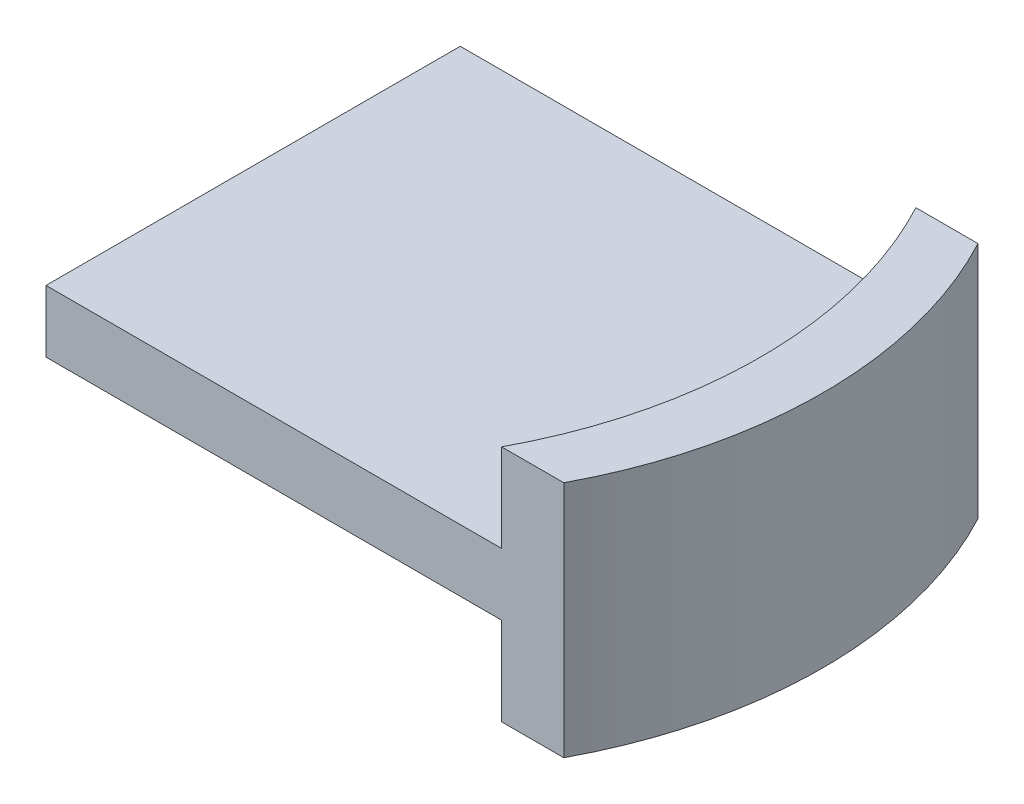
ISO-10303-21;
HEADER;
FILE_DESCRIPTION(('STEP AP214'),'2;1');
FILE_NAME('part.step','',(''),(''),'','','');
FILE_SCHEMA(('AUTOMOTIVE_DESIGN { 1 0 10303 214 1 1 1 1 }'));
ENDSEC;
DATA;
#1=APPLICATION_CONTEXT('core data for automotive mechanical design processes');
#2=APPLICATION_PROTOCOL_DEFINITION('international standard','automotive_design',2000,#1);
#3=PRODUCT_CONTEXT('',#1,'mechanical');
#4=PRODUCT('Part','Part','',(#3));
#5=PRODUCT_RELATED_PRODUCT_CATEGORY('part','',(#4));
#6=PRODUCT_DEFINITION_FORMATION('','',#4);
#7=PRODUCT_DEFINITION_CONTEXT('part definition',#1,'design');
#8=PRODUCT_DEFINITION('design','',#6,#7);
#9=PRODUCT_DEFINITION_SHAPE('','',#8);
#10=(LENGTH_UNIT() NAMED_UNIT(*) SI_UNIT(.MILLI.,.METRE.));
#11=(NAMED_UNIT(*) PLANE_ANGLE_UNIT() SI_UNIT($,.RADIAN.));
#12=(NAMED_UNIT(*) SI_UNIT($,.STERADIAN.) SOLID_ANGLE_UNIT());
#13=UNCERTAINTY_MEASURE_WITH_UNIT(LENGTH_MEASURE(1.E-05),#10,'distance_accuracy_value','');
#14=(GEOMETRIC_REPRESENTATION_CONTEXT(3) GLOBAL_UNCERTAINTY_ASSIGNED_CONTEXT((#13)) GLOBAL_UNIT_ASSIGNED_CONTEXT((#10,
#11,#12)) REPRESENTATION_CONTEXT('',''));
#15=CARTESIAN_POINT('',(0.,0.,0.));
#16=DIRECTION('',(0.,0.,1.));
#17=DIRECTION('',(1.,0.,0.));
#18=AXIS2_PLACEMENT_3D('',#15,#16,#17);
#19=CARTESIAN_POINT('',(-7.5,2.3,0.));
#20=DIRECTION('',(0.,-1.,0.));
#21=DIRECTION('',(0.,0.,-1.));
#22=AXIS2_PLACEMENT_3D('',#19,#20,#21);
#23=CYLINDRICAL_SURFACE('',#22,8.4999999999978);
#24=CARTESIAN_POINT('',(-7.5,0.6,0.));
#25=DIRECTION('',(0.,-1.,0.));
#26=DIRECTION('',(0.,0.,-1.));
#27=AXIS2_PLACEMENT_3D('',#24,#25,#26);
#28=CIRCLE('',#27,8.4999999999978);
#29=CARTESIAN_POINT('',(0.,0.6,4.));
#30=VERTEX_POINT('',#29);
#31=CARTESIAN_POINT('',(0.,0.6,-4.));
#32=VERTEX_POINT('',#31);
#33=EDGE_CURVE('E124',#30,#32,#28,.F.);
#34=ORIENTED_EDGE('',*,*,#33,.F.);
#35=DIRECTION('',(0.,-1.,0.));
#36=VECTOR('',#35,1.);
#37=CARTESIAN_POINT('',(0.,2.3,3.99999999999534));
#38=LINE('',#37,#36);
#39=CARTESIAN_POINT('',(0.,2.3,3.99999999999534));
#40=VERTEX_POINT('',#39);
#41=EDGE_CURVE('E11',#40,#30,#38,.T.);
#42=ORIENTED_EDGE('',*,*,#41,.F.);
#43=CARTESIAN_POINT('',(-7.5,2.3,0.));
#44=DIRECTION('',(0.,-1.,0.));
#45=DIRECTION('',(0.,0.,-1.));
#46=AXIS2_PLACEMENT_3D('',#43,#44,#45);
#47=CIRCLE('',#46,8.4999999999978);
#48=CARTESIAN_POINT('',(0.,2.3,-3.99999999999534));
#49=VERTEX_POINT('',#48);
#50=EDGE_CURVE('E162',#49,#40,#47,.T.);
#51=ORIENTED_EDGE('',*,*,#50,.F.);
#52=DIRECTION('',(0.,-1.,0.));
#53=VECTOR('',#52,1.);
#54=CARTESIAN_POINT('',(0.,2.3,-3.99999999999534));
#55=LINE('',#54,#53);
#56=EDGE_CURVE('E185',#49,#32,#55,.T.);
#57=ORIENTED_EDGE('',*,*,#56,.T.);
#58=EDGE_LOOP('',(#34,#42,#51,#57));
#59=FACE_BOUND('',#58,.T.);
#60=ADVANCED_FACE('F43',(#59),#23,.F.);
#61=CARTESIAN_POINT('',(0.,-0.6,4.));
#62=VERTEX_POINT('',#61);
#63=CARTESIAN_POINT('',(0.,-2.3,3.99999999999534));
#64=VERTEX_POINT('',#63);
#65=EDGE_CURVE('E52',#62,#64,#38,.T.);
#66=ORIENTED_EDGE('',*,*,#65,.F.);
#67=CARTESIAN_POINT('',(-7.5,-0.6,0.));
#68=DIRECTION('',(0.,-1.,0.));
#69=DIRECTION('',(0.,0.,-1.));
#70=AXIS2_PLACEMENT_3D('',#67,#68,#69);
#71=CIRCLE('',#70,8.4999999999978);
#72=CARTESIAN_POINT('',(0.,-0.6,-3.99999999999534));
#73=VERTEX_POINT('',#72);
#74=EDGE_CURVE('E135',#62,#73,#71,.F.);
#75=ORIENTED_EDGE('',*,*,#74,.T.);
#76=CARTESIAN_POINT('',(0.,-2.3,-3.99999999999534));
#77=VERTEX_POINT('',#76);
#78=EDGE_CURVE('E89',#73,#77,#55,.T.);
#79=ORIENTED_EDGE('',*,*,#78,.T.);
#80=CARTESIAN_POINT('',(-7.5,-2.3,0.));
#81=DIRECTION('',(0.,-1.,0.));
#82=DIRECTION('',(0.,0.,-1.));
#83=AXIS2_PLACEMENT_3D('',#80,#81,#82);
#84=CIRCLE('',#83,8.4999999999978);
#85=EDGE_CURVE('E161',#77,#64,#84,.T.);
#86=ORIENTED_EDGE('',*,*,#85,.T.);
#87=EDGE_LOOP('',(#66,#75,#79,#86));
#88=FACE_BOUND('',#87,.T.);
#89=ADVANCED_FACE('F45',(#88),#23,.F.);
#90=CARTESIAN_POINT('',(1.2,2.3,4.));
#91=DIRECTION('',(3.8843349832914E-12,0.,-1.));
#92=DIRECTION('',(-1.,0.,-3.8843349832914E-12));
#93=AXIS2_PLACEMENT_3D('',#90,#91,#92);
#94=PLANE('',#93);
#95=DIRECTION('',(1.,0.,3.8843349832914E-12));
#96=VECTOR('',#95,1.);
#97=CARTESIAN_POINT('',(1.2,-2.3,4.));
#98=LINE('',#97,#96);
#99=CARTESIAN_POINT('',(1.2,-2.3,4.));
#100=VERTEX_POINT('',#99);
#101=EDGE_CURVE('E175',#64,#100,#98,.T.);
#102=ORIENTED_EDGE('',*,*,#101,.T.);
#103=DIRECTION('',(0.,-1.,0.));
#104=VECTOR('',#103,1.);
#105=CARTESIAN_POINT('',(1.2,2.3,4.));
#106=LINE('',#105,#104);
#107=CARTESIAN_POINT('',(1.2,2.3,4.));
#108=VERTEX_POINT('',#107);
#109=EDGE_CURVE('E190',#108,#100,#106,.T.);
#110=ORIENTED_EDGE('',*,*,#109,.F.);
#111=DIRECTION('',(1.,0.,3.8843349832914E-12));
#112=VECTOR('',#111,1.);
#113=CARTESIAN_POINT('',(1.2,2.3,4.));
#114=LINE('',#113,#112);
#115=EDGE_CURVE('E96',#40,#108,#114,.T.);
#116=ORIENTED_EDGE('',*,*,#115,.F.);
#117=ORIENTED_EDGE('',*,*,#41,.T.);
#118=DIRECTION('',(1.,0.,0.));
#119=VECTOR('',#118,1.);
#120=CARTESIAN_POINT('',(1.2,0.6,4.));
#121=LINE('',#120,#119);
#122=CARTESIAN_POINT('',(-8.8,0.6,4.));
#123=VERTEX_POINT('',#122);
#124=EDGE_CURVE('E142',#123,#30,#121,.T.);
#125=ORIENTED_EDGE('',*,*,#124,.F.);
#126=DIRECTION('',(0.,-1.,0.));
#127=VECTOR('',#126,1.);
#128=CARTESIAN_POINT('',(-8.8,0.6,4.));
#129=LINE('',#128,#127);
#130=CARTESIAN_POINT('',(-8.8,-0.6,4.));
#131=VERTEX_POINT('',#130);
#132=EDGE_CURVE('E136',#123,#131,#129,.T.);
#133=ORIENTED_EDGE('',*,*,#132,.T.);
#134=DIRECTION('',(1.,0.,0.));
#135=VECTOR('',#134,1.);
#136=CARTESIAN_POINT('',(1.2,-0.6,4.));
#137=LINE('',#136,#135);
#138=EDGE_CURVE('E128',#131,#62,#137,.T.);
#139=ORIENTED_EDGE('',*,*,#138,.T.);
#140=ORIENTED_EDGE('',*,*,#65,.T.);
#141=EDGE_LOOP('',(#102,#110,#116,#117,#125,#133,#139,#140));
#142=FACE_BOUND('',#141,.T.);
#143=ADVANCED_FACE('F197',(#142),#94,.F.);
#144=CARTESIAN_POINT('',(-6.3,2.3,0.));
#145=DIRECTION('',(0.,-1.,0.));
#146=DIRECTION('',(0.,0.,-1.));
#147=AXIS2_PLACEMENT_3D('',#144,#145,#146);
#148=CYLINDRICAL_SURFACE('',#147,8.49999999999999);
#149=CARTESIAN_POINT('',(-6.3,-2.3,0.));
#150=DIRECTION('',(0.,1.,0.));
#151=DIRECTION('',(0.,0.,-1.));
#152=AXIS2_PLACEMENT_3D('',#149,#150,#151);
#153=CIRCLE('',#152,8.49999999999999);
#154=CARTESIAN_POINT('',(1.2,-2.3,-4.));
#155=VERTEX_POINT('',#154);
#156=EDGE_CURVE('E179',#100,#155,#153,.T.);
#157=ORIENTED_EDGE('',*,*,#156,.T.);
#158=DIRECTION('',(0.,-1.,0.));
#159=VECTOR('',#158,1.);
#160=CARTESIAN_POINT('',(1.2,2.3,-4.));
#161=LINE('',#160,#159);
#162=CARTESIAN_POINT('',(1.2,2.3,-4.));
#163=VERTEX_POINT('',#162);
#164=EDGE_CURVE('E188',#163,#155,#161,.T.);
#165=ORIENTED_EDGE('',*,*,#164,.F.);
#166=CARTESIAN_POINT('',(-6.3,2.3,0.));
#167=DIRECTION('',(0.,1.,0.));
#168=DIRECTION('',(0.,0.,-1.));
#169=AXIS2_PLACEMENT_3D('',#166,#167,#168);
#170=CIRCLE('',#169,8.49999999999999);
#171=EDGE_CURVE('E168',#108,#163,#170,.T.);
#172=ORIENTED_EDGE('',*,*,#171,.F.);
#173=ORIENTED_EDGE('',*,*,#109,.T.);
#174=EDGE_LOOP('',(#157,#165,#172,#173));
#175=FACE_BOUND('',#174,.T.);
#176=ADVANCED_FACE('F209',(#175),#148,.T.);
#177=CARTESIAN_POINT('',(0.,2.3,-3.99999999999534));
#178=DIRECTION('',(3.8843349832914E-12,0.,1.));
#179=DIRECTION('',(1.,0.,-3.8843349832914E-12));
#180=AXIS2_PLACEMENT_3D('',#177,#178,#179);
#181=PLANE('',#180);
#182=ORIENTED_EDGE('',*,*,#78,.F.);
#183=DIRECTION('',(-1.,0.,0.));
#184=VECTOR('',#183,1.);
#185=CARTESIAN_POINT('',(1.2,-0.6,-4.));
#186=LINE('',#185,#184);
#187=CARTESIAN_POINT('',(-8.8,-0.6,-4.));
#188=VERTEX_POINT('',#187);
#189=EDGE_CURVE('E59',#73,#188,#186,.T.);
#190=ORIENTED_EDGE('',*,*,#189,.T.);
#191=DIRECTION('',(0.,-1.,0.));
#192=VECTOR('',#191,1.);
#193=CARTESIAN_POINT('',(-8.8,0.6,-4.));
#194=LINE('',#193,#192);
#195=CARTESIAN_POINT('',(-8.8,0.6,-4.));
#196=VERTEX_POINT('',#195);
#197=EDGE_CURVE('E131',#196,#188,#194,.T.);
#198=ORIENTED_EDGE('',*,*,#197,.F.);
#199=DIRECTION('',(-1.,0.,0.));
#200=VECTOR('',#199,1.);
#201=CARTESIAN_POINT('',(1.2,0.6,-4.));
#202=LINE('',#201,#200);
#203=EDGE_CURVE('E117',#32,#196,#202,.T.);
#204=ORIENTED_EDGE('',*,*,#203,.F.);
#205=ORIENTED_EDGE('',*,*,#56,.F.);
#206=DIRECTION('',(-1.,0.,3.8843349832914E-12));
#207=VECTOR('',#206,1.);
#208=CARTESIAN_POINT('',(0.,2.3,-3.99999999999534));
#209=LINE('',#208,#207);
#210=EDGE_CURVE('E68',#163,#49,#209,.T.);
#211=ORIENTED_EDGE('',*,*,#210,.F.);
#212=ORIENTED_EDGE('',*,*,#164,.T.);
#213=DIRECTION('',(-1.,0.,3.8843349832914E-12));
#214=VECTOR('',#213,1.);
#215=CARTESIAN_POINT('',(0.,-2.3,-3.99999999999534));
#216=LINE('',#215,#214);
#217=EDGE_CURVE('E165',#155,#77,#216,.T.);
#218=ORIENTED_EDGE('',*,*,#217,.T.);
#219=EDGE_LOOP('',(#182,#190,#198,#204,#205,#211,#212,#218));
#220=FACE_BOUND('',#219,.T.);
#221=ADVANCED_FACE('F132',(#220),#181,.F.);
#222=CARTESIAN_POINT('',(-7.5,2.3,0.));
#223=DIRECTION('',(0.,-1.,0.));
#224=DIRECTION('',(0.,0.,-1.));
#225=AXIS2_PLACEMENT_3D('',#222,#223,#224);
#226=PLANE('',#225);
#227=ORIENTED_EDGE('',*,*,#50,.T.);
#228=ORIENTED_EDGE('',*,*,#115,.T.);
#229=ORIENTED_EDGE('',*,*,#171,.T.);
#230=ORIENTED_EDGE('',*,*,#210,.T.);
#231=EDGE_LOOP('',(#227,#228,#229,#230));
#232=FACE_BOUND('',#231,.T.);
#233=ADVANCED_FACE('F223',(#232),#226,.F.);
#234=CARTESIAN_POINT('',(-7.5,-2.3,0.));
#235=DIRECTION('',(0.,-1.,0.));
#236=DIRECTION('',(0.,0.,-1.));
#237=AXIS2_PLACEMENT_3D('',#234,#235,#236);
#238=PLANE('',#237);
#239=ORIENTED_EDGE('',*,*,#85,.F.);
#240=ORIENTED_EDGE('',*,*,#217,.F.);
#241=ORIENTED_EDGE('',*,*,#156,.F.);
#242=ORIENTED_EDGE('',*,*,#101,.F.);
#243=EDGE_LOOP('',(#239,#240,#241,#242));
#244=FACE_BOUND('',#243,.T.);
#245=ADVANCED_FACE('F202',(#244),#238,.T.);
#246=CARTESIAN_POINT('',(0.,0.6,0.));
#247=DIRECTION('',(0.,-1.,0.));
#248=DIRECTION('',(0.,0.,-1.));
#249=AXIS2_PLACEMENT_3D('',#246,#247,#248);
#250=PLANE('',#249);
#251=ORIENTED_EDGE('',*,*,#124,.T.);
#252=ORIENTED_EDGE('',*,*,#33,.T.);
#253=ORIENTED_EDGE('',*,*,#203,.T.);
#254=DIRECTION('',(0.,0.,1.));
#255=VECTOR('',#254,1.);
#256=CARTESIAN_POINT('',(-8.8,0.6,-4.));
#257=LINE('',#256,#255);
#258=EDGE_CURVE('E121',#196,#123,#257,.T.);
#259=ORIENTED_EDGE('',*,*,#258,.T.);
#260=EDGE_LOOP('',(#251,#252,#253,#259));
#261=FACE_BOUND('',#260,.T.);
#262=ADVANCED_FACE('F119',(#261),#250,.F.);
#263=CARTESIAN_POINT('',(0.,-0.6,0.));
#264=DIRECTION('',(0.,-1.,0.));
#265=DIRECTION('',(0.,0.,-1.));
#266=AXIS2_PLACEMENT_3D('',#263,#264,#265);
#267=PLANE('',#266);
#268=ORIENTED_EDGE('',*,*,#74,.F.);
#269=ORIENTED_EDGE('',*,*,#138,.F.);
#270=DIRECTION('',(0.,0.,1.));
#271=VECTOR('',#270,1.);
#272=CARTESIAN_POINT('',(-8.8,-0.6,-4.));
#273=LINE('',#272,#271);
#274=EDGE_CURVE('E149',#188,#131,#273,.T.);
#275=ORIENTED_EDGE('',*,*,#274,.F.);
#276=ORIENTED_EDGE('',*,*,#189,.F.);
#277=EDGE_LOOP('',(#268,#269,#275,#276));
#278=FACE_BOUND('',#277,.T.);
#279=ADVANCED_FACE('F215',(#278),#267,.T.);
#280=CARTESIAN_POINT('',(-8.8,0.6,-4.));
#281=DIRECTION('',(1.,0.,0.));
#282=DIRECTION('',(0.,0.,-1.));
#283=AXIS2_PLACEMENT_3D('',#280,#281,#282);
#284=PLANE('',#283);
#285=ORIENTED_EDGE('',*,*,#274,.T.);
#286=ORIENTED_EDGE('',*,*,#132,.F.);
#287=ORIENTED_EDGE('',*,*,#258,.F.);
#288=ORIENTED_EDGE('',*,*,#197,.T.);
#289=EDGE_LOOP('',(#285,#286,#287,#288));
#290=FACE_BOUND('',#289,.T.);
#291=ADVANCED_FACE('F138',(#290),#284,.F.);
#292=CLOSED_SHELL('',(#60,#89,#143,#176,#221,#233,#245,#262,#279,#291));
#293=MANIFOLD_SOLID_BREP('B2',#292);
#294=ADVANCED_BREP_SHAPE_REPRESENTATION('',(#18,#293),#14);
#295=SHAPE_DEFINITION_REPRESENTATION(#9,#294);
ENDSEC;
END-ISO-10303-21;
